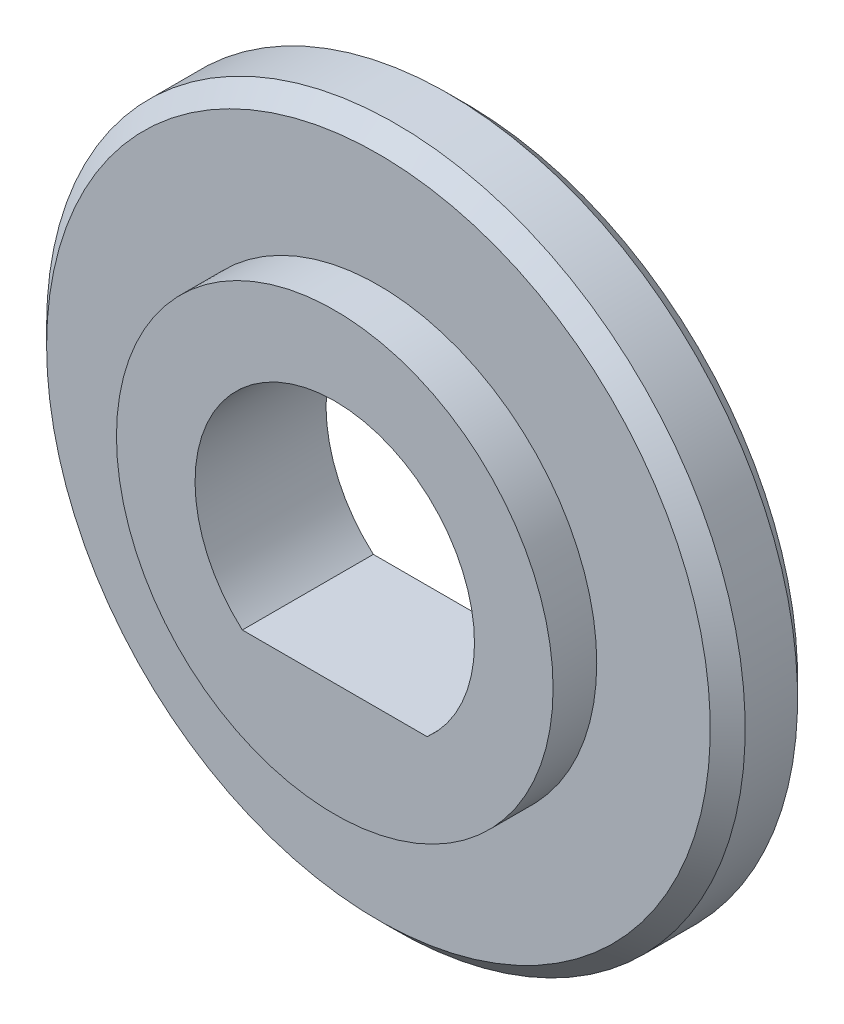
ISO-10303-21;
HEADER;
FILE_DESCRIPTION(('STEP AP214'),'2;1');
FILE_NAME('part.step','',(''),(''),'','','');
FILE_SCHEMA(('AUTOMOTIVE_DESIGN { 1 0 10303 214 1 1 1 1 }'));
ENDSEC;
DATA;
#1=APPLICATION_CONTEXT('core data for automotive mechanical design processes');
#2=APPLICATION_PROTOCOL_DEFINITION('international standard','automotive_design',2000,#1);
#3=PRODUCT_CONTEXT('',#1,'mechanical');
#4=PRODUCT('Part','Part','',(#3));
#5=PRODUCT_RELATED_PRODUCT_CATEGORY('part','',(#4));
#6=PRODUCT_DEFINITION_FORMATION('','',#4);
#7=PRODUCT_DEFINITION_CONTEXT('part definition',#1,'design');
#8=PRODUCT_DEFINITION('design','',#6,#7);
#9=PRODUCT_DEFINITION_SHAPE('','',#8);
#10=(LENGTH_UNIT() NAMED_UNIT(*) SI_UNIT(.MILLI.,.METRE.));
#11=(NAMED_UNIT(*) PLANE_ANGLE_UNIT() SI_UNIT($,.RADIAN.));
#12=(NAMED_UNIT(*) SI_UNIT($,.STERADIAN.) SOLID_ANGLE_UNIT());
#13=UNCERTAINTY_MEASURE_WITH_UNIT(LENGTH_MEASURE(1.E-05),#10,'distance_accuracy_value','');
#14=(GEOMETRIC_REPRESENTATION_CONTEXT(3) GLOBAL_UNCERTAINTY_ASSIGNED_CONTEXT((#13)) GLOBAL_UNIT_ASSIGNED_CONTEXT((#10,
#11,#12)) REPRESENTATION_CONTEXT('',''));
#15=CARTESIAN_POINT('',(0.,0.,0.));
#16=DIRECTION('',(0.,0.,1.));
#17=DIRECTION('',(1.,0.,0.));
#18=AXIS2_PLACEMENT_3D('',#15,#16,#17);
#19=CARTESIAN_POINT('',(0.,0.,2.5));
#20=DIRECTION('',(0.,0.,-1.));
#21=DIRECTION('',(-1.,0.,0.));
#22=AXIS2_PLACEMENT_3D('',#19,#20,#21);
#23=CYLINDRICAL_SURFACE('',#22,8.);
#24=CARTESIAN_POINT('',(0.,0.,2.5));
#25=DIRECTION('',(0.,0.,1.));
#26=DIRECTION('',(1.,0.,0.));
#27=AXIS2_PLACEMENT_3D('',#24,#25,#26);
#28=CIRCLE('',#27,8.);
#29=CARTESIAN_POINT('',(5.29150262212918,-6.,2.5));
#30=VERTEX_POINT('',#29);
#31=CARTESIAN_POINT('',(-5.29150262212918,-6.,2.5));
#32=VERTEX_POINT('',#31);
#33=EDGE_CURVE('E69',#30,#32,#28,.T.);
#34=ORIENTED_EDGE('',*,*,#33,.T.);
#35=DIRECTION('',(0.,0.,-1.));
#36=VECTOR('',#35,1.);
#37=CARTESIAN_POINT('',(-5.29150262212918,-6.,2.5));
#38=LINE('',#37,#36);
#39=CARTESIAN_POINT('',(-5.29150262212918,-6.,-5.));
#40=VERTEX_POINT('',#39);
#41=EDGE_CURVE('E56',#32,#40,#38,.T.);
#42=ORIENTED_EDGE('',*,*,#41,.T.);
#43=CARTESIAN_POINT('',(0.,0.,-5.));
#44=DIRECTION('',(0.,0.,-1.));
#45=DIRECTION('',(-1.,0.,0.));
#46=AXIS2_PLACEMENT_3D('',#43,#44,#45);
#47=CIRCLE('',#46,8.);
#48=CARTESIAN_POINT('',(5.29150262212918,-6.,-5.));
#49=VERTEX_POINT('',#48);
#50=EDGE_CURVE('E62',#40,#49,#47,.T.);
#51=ORIENTED_EDGE('',*,*,#50,.T.);
#52=DIRECTION('',(0.,0.,-1.));
#53=VECTOR('',#52,1.);
#54=CARTESIAN_POINT('',(5.29150262212918,-6.,2.5));
#55=LINE('',#54,#53);
#56=EDGE_CURVE('E63',#49,#30,#55,.F.);
#57=ORIENTED_EDGE('',*,*,#56,.T.);
#58=EDGE_LOOP('',(#34,#42,#51,#57));
#59=FACE_BOUND('',#58,.T.);
#60=ADVANCED_FACE('F31',(#59),#23,.F.);
#61=CARTESIAN_POINT('',(0.,0.,2.5));
#62=DIRECTION('',(0.,0.,1.));
#63=DIRECTION('',(1.,0.,0.));
#64=AXIS2_PLACEMENT_3D('',#61,#62,#63);
#65=PLANE('',#64);
#66=DIRECTION('',(1.,0.,0.));
#67=VECTOR('',#66,1.);
#68=CARTESIAN_POINT('',(-5.5,-6.,2.5));
#69=LINE('',#68,#67);
#70=EDGE_CURVE('E46',#32,#30,#69,.T.);
#71=ORIENTED_EDGE('',*,*,#70,.F.);
#72=ORIENTED_EDGE('',*,*,#33,.F.);
#73=EDGE_LOOP('',(#71,#72));
#74=FACE_BOUND('',#73,.T.);
#75=CARTESIAN_POINT('',(0.,0.,2.5));
#76=DIRECTION('',(0.,0.,1.));
#77=DIRECTION('',(1.,0.,0.));
#78=AXIS2_PLACEMENT_3D('',#75,#76,#77);
#79=CIRCLE('',#78,12.5);
#80=CARTESIAN_POINT('',(12.5,0.,2.5));
#81=VERTEX_POINT('',#80);
#82=EDGE_CURVE('E71',#81,#81,#79,.T.);
#83=ORIENTED_EDGE('',*,*,#82,.T.);
#84=EDGE_LOOP('',(#83));
#85=FACE_BOUND('',#84,.T.);
#86=ADVANCED_FACE('F67',(#74,#85),#65,.T.);
#87=CARTESIAN_POINT('',(0.,0.,2.5));
#88=DIRECTION('',(0.,0.,-1.));
#89=DIRECTION('',(-1.,0.,0.));
#90=AXIS2_PLACEMENT_3D('',#87,#88,#89);
#91=CYLINDRICAL_SURFACE('',#90,12.5);
#92=ORIENTED_EDGE('',*,*,#82,.F.);
#93=EDGE_LOOP('',(#92));
#94=FACE_BOUND('',#93,.T.);
#95=CARTESIAN_POINT('',(0.,0.,0.));
#96=DIRECTION('',(0.,0.,-1.));
#97=DIRECTION('',(-1.,0.,0.));
#98=AXIS2_PLACEMENT_3D('',#95,#96,#97);
#99=CIRCLE('',#98,12.5);
#100=CARTESIAN_POINT('',(-12.5,0.,0.));
#101=VERTEX_POINT('',#100);
#102=EDGE_CURVE('E72',#101,#101,#99,.T.);
#103=ORIENTED_EDGE('',*,*,#102,.F.);
#104=EDGE_LOOP('',(#103));
#105=FACE_BOUND('',#104,.T.);
#106=ADVANCED_FACE('F113',(#94,#105),#91,.T.);
#107=CARTESIAN_POINT('',(0.,0.,0.));
#108=DIRECTION('',(0.,0.,-1.));
#109=DIRECTION('',(-1.,0.,0.));
#110=AXIS2_PLACEMENT_3D('',#107,#108,#109);
#111=PLANE('',#110);
#112=CARTESIAN_POINT('',(0.,0.,0.));
#113=DIRECTION('',(0.,0.,-1.));
#114=DIRECTION('',(-1.,0.,0.));
#115=AXIS2_PLACEMENT_3D('',#112,#113,#114);
#116=CIRCLE('',#115,19.);
#117=CARTESIAN_POINT('',(-19.,0.,0.));
#118=VERTEX_POINT('',#117);
#119=EDGE_CURVE('E39',#118,#118,#116,.F.);
#120=ORIENTED_EDGE('',*,*,#119,.T.);
#121=EDGE_LOOP('',(#120));
#122=FACE_BOUND('',#121,.T.);
#123=ORIENTED_EDGE('',*,*,#102,.T.);
#124=EDGE_LOOP('',(#123));
#125=FACE_BOUND('',#124,.T.);
#126=ADVANCED_FACE('F88',(#122,#125),#111,.F.);
#127=CARTESIAN_POINT('',(0.,0.,-5.));
#128=DIRECTION('',(0.,0.,-1.));
#129=DIRECTION('',(-1.,0.,0.));
#130=AXIS2_PLACEMENT_3D('',#127,#128,#129);
#131=PLANE('',#130);
#132=ORIENTED_EDGE('',*,*,#50,.F.);
#133=DIRECTION('',(-1.,0.,0.));
#134=VECTOR('',#133,1.);
#135=CARTESIAN_POINT('',(-5.5,-6.,-5.));
#136=LINE('',#135,#134);
#137=EDGE_CURVE('E51',#49,#40,#136,.T.);
#138=ORIENTED_EDGE('',*,*,#137,.F.);
#139=EDGE_LOOP('',(#132,#138));
#140=FACE_BOUND('',#139,.T.);
#141=CARTESIAN_POINT('',(0.,0.,-5.));
#142=DIRECTION('',(0.,0.,-1.));
#143=DIRECTION('',(-1.,0.,0.));
#144=AXIS2_PLACEMENT_3D('',#141,#142,#143);
#145=CIRCLE('',#144,19.);
#146=CARTESIAN_POINT('',(-19.,0.,-5.));
#147=VERTEX_POINT('',#146);
#148=EDGE_CURVE('E11',#147,#147,#145,.T.);
#149=ORIENTED_EDGE('',*,*,#148,.T.);
#150=EDGE_LOOP('',(#149));
#151=FACE_BOUND('',#150,.T.);
#152=ADVANCED_FACE('F99',(#140,#151),#131,.T.);
#153=CARTESIAN_POINT('',(0.,0.,-5.));
#154=DIRECTION('',(0.,0.,1.));
#155=DIRECTION('',(1.,0.,0.));
#156=AXIS2_PLACEMENT_3D('',#153,#154,#155);
#157=CYLINDRICAL_SURFACE('',#156,20.);
#158=CARTESIAN_POINT('',(0.,0.,-1.));
#159=DIRECTION('',(0.,0.,-1.));
#160=DIRECTION('',(-1.,0.,0.));
#161=AXIS2_PLACEMENT_3D('',#158,#159,#160);
#162=CIRCLE('',#161,20.);
#163=CARTESIAN_POINT('',(-20.,0.,-1.));
#164=VERTEX_POINT('',#163);
#165=EDGE_CURVE('E83',#164,#164,#162,.T.);
#166=ORIENTED_EDGE('',*,*,#165,.T.);
#167=EDGE_LOOP('',(#166));
#168=FACE_BOUND('',#167,.T.);
#169=CARTESIAN_POINT('',(0.,0.,-3.99999999999999));
#170=DIRECTION('',(0.,0.,-1.));
#171=DIRECTION('',(-1.,0.,0.));
#172=AXIS2_PLACEMENT_3D('',#169,#170,#171);
#173=CIRCLE('',#172,20.);
#174=CARTESIAN_POINT('',(-20.,0.,-3.99999999999999));
#175=VERTEX_POINT('',#174);
#176=EDGE_CURVE('E75',#175,#175,#173,.F.);
#177=ORIENTED_EDGE('',*,*,#176,.T.);
#178=EDGE_LOOP('',(#177));
#179=FACE_BOUND('',#178,.T.);
#180=ADVANCED_FACE('F94',(#168,#179),#157,.T.);
#181=CARTESIAN_POINT('',(0.,0.,-1.));
#182=DIRECTION('',(0.,0.,-1.));
#183=DIRECTION('',(-1.,0.,0.));
#184=AXIS2_PLACEMENT_3D('',#181,#182,#183);
#185=CONICAL_SURFACE('',#184,20.,0.785398163397452);
#186=ORIENTED_EDGE('',*,*,#119,.F.);
#187=EDGE_LOOP('',(#186));
#188=FACE_BOUND('',#187,.T.);
#189=ORIENTED_EDGE('',*,*,#165,.F.);
#190=EDGE_LOOP('',(#189));
#191=FACE_BOUND('',#190,.T.);
#192=ADVANCED_FACE('F91',(#188,#191),#185,.T.);
#193=CARTESIAN_POINT('',(0.,0.,-5.));
#194=DIRECTION('',(0.,0.,1.));
#195=DIRECTION('',(1.,0.,0.));
#196=AXIS2_PLACEMENT_3D('',#193,#194,#195);
#197=CONICAL_SURFACE('',#196,19.,0.785398163397448);
#198=ORIENTED_EDGE('',*,*,#176,.F.);
#199=EDGE_LOOP('',(#198));
#200=FACE_BOUND('',#199,.T.);
#201=ORIENTED_EDGE('',*,*,#148,.F.);
#202=EDGE_LOOP('',(#201));
#203=FACE_BOUND('',#202,.T.);
#204=ADVANCED_FACE('F33',(#200,#203),#197,.T.);
#205=CARTESIAN_POINT('',(-5.5,-6.,-5.));
#206=DIRECTION('',(0.,-1.,0.));
#207=DIRECTION('',(0.,0.,-1.));
#208=AXIS2_PLACEMENT_3D('',#205,#206,#207);
#209=PLANE('',#208);
#210=ORIENTED_EDGE('',*,*,#41,.F.);
#211=ORIENTED_EDGE('',*,*,#70,.T.);
#212=ORIENTED_EDGE('',*,*,#56,.F.);
#213=ORIENTED_EDGE('',*,*,#137,.T.);
#214=EDGE_LOOP('',(#210,#211,#212,#213));
#215=FACE_BOUND('',#214,.T.);
#216=ADVANCED_FACE('F57',(#215),#209,.F.);
#217=CLOSED_SHELL('',(#60,#86,#106,#126,#152,#180,#192,#204,#216));
#218=MANIFOLD_SOLID_BREP('B2',#217);
#219=ADVANCED_BREP_SHAPE_REPRESENTATION('',(#18,#218),#14);
#220=SHAPE_DEFINITION_REPRESENTATION(#9,#219);
ENDSEC;
END-ISO-10303-21;
